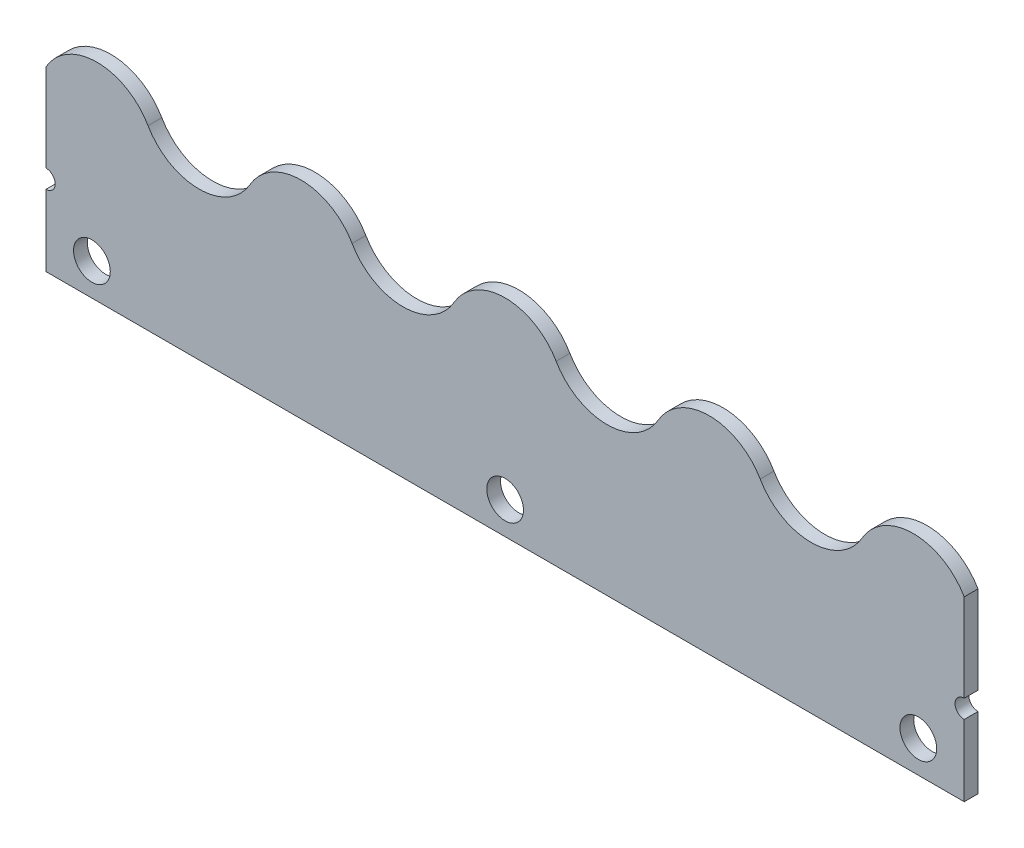
ISO-10303-21;
HEADER;
FILE_DESCRIPTION(('STEP AP214'),'2;1');
FILE_NAME('part.step','',(''),(''),'','','');
FILE_SCHEMA(('AUTOMOTIVE_DESIGN { 1 0 10303 214 1 1 1 1 }'));
ENDSEC;
DATA;
#1=APPLICATION_CONTEXT('core data for automotive mechanical design processes');
#2=APPLICATION_PROTOCOL_DEFINITION('international standard','automotive_design',2000,#1);
#3=PRODUCT_CONTEXT('',#1,'mechanical');
#4=PRODUCT('Part','Part','',(#3));
#5=PRODUCT_RELATED_PRODUCT_CATEGORY('part','',(#4));
#6=PRODUCT_DEFINITION_FORMATION('','',#4);
#7=PRODUCT_DEFINITION_CONTEXT('part definition',#1,'design');
#8=PRODUCT_DEFINITION('design','',#6,#7);
#9=PRODUCT_DEFINITION_SHAPE('','',#8);
#10=(LENGTH_UNIT() NAMED_UNIT(*) SI_UNIT(.MILLI.,.METRE.));
#11=(NAMED_UNIT(*) PLANE_ANGLE_UNIT() SI_UNIT($,.RADIAN.));
#12=(NAMED_UNIT(*) SI_UNIT($,.STERADIAN.) SOLID_ANGLE_UNIT());
#13=UNCERTAINTY_MEASURE_WITH_UNIT(LENGTH_MEASURE(1.E-05),#10,'distance_accuracy_value','');
#14=(GEOMETRIC_REPRESENTATION_CONTEXT(3) GLOBAL_UNCERTAINTY_ASSIGNED_CONTEXT((#13)) GLOBAL_UNIT_ASSIGNED_CONTEXT((#10,
#11,#12)) REPRESENTATION_CONTEXT('',''));
#15=CARTESIAN_POINT('',(0.,0.,0.));
#16=DIRECTION('',(0.,0.,1.));
#17=DIRECTION('',(1.,0.,0.));
#18=AXIS2_PLACEMENT_3D('',#15,#16,#17);
#19=CARTESIAN_POINT('',(0.,0.965708264711482,-3.));
#20=DIRECTION('',(-1.,0.,0.));
#21=DIRECTION('',(0.,1.,0.));
#22=AXIS2_PLACEMENT_3D('',#19,#20,#21);
#23=PLANE('',#22);
#24=DIRECTION('',(0.,0.,1.));
#25=VECTOR('',#24,1.);
#26=CARTESIAN_POINT('',(0.,0.232854132355741,-1.5));
#27=LINE('',#26,#25);
#28=CARTESIAN_POINT('',(0.,0.232854132355741,-1.5));
#29=VERTEX_POINT('',#28);
#30=CARTESIAN_POINT('',(0.,0.232854132355741,0.));
#31=VERTEX_POINT('',#30);
#32=EDGE_CURVE('E232',#29,#31,#27,.T.);
#33=ORIENTED_EDGE('',*,*,#32,.F.);
#34=DIRECTION('',(0.,1.,0.));
#35=VECTOR('',#34,1.);
#36=CARTESIAN_POINT('',(0.,-7.53429173528852,-1.5));
#37=LINE('',#36,#35);
#38=CARTESIAN_POINT('',(0.,-7.53429173528852,-1.5));
#39=VERTEX_POINT('',#38);
#40=EDGE_CURVE('E179',#39,#29,#37,.T.);
#41=ORIENTED_EDGE('',*,*,#40,.F.);
#42=DIRECTION('',(0.,0.,1.));
#43=VECTOR('',#42,1.);
#44=CARTESIAN_POINT('',(0.,-7.53429173528852,-1.5));
#45=LINE('',#44,#43);
#46=CARTESIAN_POINT('',(0.,-7.53429173528852,0.));
#47=VERTEX_POINT('',#46);
#48=EDGE_CURVE('E204',#39,#47,#45,.T.);
#49=ORIENTED_EDGE('',*,*,#48,.T.);
#50=DIRECTION('',(0.,1.,0.));
#51=VECTOR('',#50,1.);
#52=CARTESIAN_POINT('',(0.,-7.53429173528852,0.));
#53=LINE('',#52,#51);
#54=EDGE_CURVE('E200',#47,#31,#53,.T.);
#55=ORIENTED_EDGE('',*,*,#54,.T.);
#56=EDGE_LOOP('',(#33,#41,#49,#55));
#57=FACE_BOUND('',#56,.T.);
#58=ADVANCED_FACE('F45',(#57),#23,.T.);
#59=CARTESIAN_POINT('',(100.,-0.534291735288518,-3.));
#60=DIRECTION('',(1.,0.,0.));
#61=DIRECTION('',(0.,-1.,0.));
#62=AXIS2_PLACEMENT_3D('',#59,#60,#61);
#63=PLANE('',#62);
#64=DIRECTION('',(0.,0.,1.));
#65=VECTOR('',#64,1.);
#66=CARTESIAN_POINT('',(100.,2.23285413235574,-1.5));
#67=LINE('',#66,#65);
#68=CARTESIAN_POINT('',(100.,2.23285413235574,-1.5));
#69=VERTEX_POINT('',#68);
#70=CARTESIAN_POINT('',(100.,2.23285413235574,0.));
#71=VERTEX_POINT('',#70);
#72=EDGE_CURVE('E54',#69,#71,#67,.T.);
#73=ORIENTED_EDGE('',*,*,#72,.F.);
#74=DIRECTION('',(0.,1.,0.));
#75=VECTOR('',#74,1.);
#76=CARTESIAN_POINT('',(100.,-7.53429173528852,-1.5));
#77=LINE('',#76,#75);
#78=CARTESIAN_POINT('',(100.,11.7924985045021,-1.5));
#79=VERTEX_POINT('',#78);
#80=EDGE_CURVE('E194',#69,#79,#77,.T.);
#81=ORIENTED_EDGE('',*,*,#80,.T.);
#82=DIRECTION('',(0.,0.,1.));
#83=VECTOR('',#82,1.);
#84=CARTESIAN_POINT('',(100.,11.7924985045021,-102.019615432912));
#85=LINE('',#84,#83);
#86=CARTESIAN_POINT('',(100.,11.7924985045021,0.));
#87=VERTEX_POINT('',#86);
#88=EDGE_CURVE('E177',#79,#87,#85,.T.);
#89=ORIENTED_EDGE('',*,*,#88,.T.);
#90=DIRECTION('',(0.,1.,0.));
#91=VECTOR('',#90,1.);
#92=CARTESIAN_POINT('',(100.,-7.53429173528852,0.));
#93=LINE('',#92,#91);
#94=EDGE_CURVE('E168',#71,#87,#93,.T.);
#95=ORIENTED_EDGE('',*,*,#94,.F.);
#96=EDGE_LOOP('',(#73,#81,#89,#95));
#97=FACE_BOUND('',#96,.T.);
#98=ADVANCED_FACE('F175',(#97),#63,.T.);
#99=DIRECTION('',(0.,0.,1.));
#100=VECTOR('',#99,1.);
#101=CARTESIAN_POINT('',(0.,2.23285413235574,-1.5));
#102=LINE('',#101,#100);
#103=CARTESIAN_POINT('',(0.,2.23285413235574,0.));
#104=VERTEX_POINT('',#103);
#105=CARTESIAN_POINT('',(0.,2.23285413235574,-1.5));
#106=VERTEX_POINT('',#105);
#107=EDGE_CURVE('E61',#104,#106,#102,.F.);
#108=ORIENTED_EDGE('',*,*,#107,.F.);
#109=CARTESIAN_POINT('',(0.,11.7924985045021,0.));
#110=VERTEX_POINT('',#109);
#111=EDGE_CURVE('E205',#104,#110,#53,.T.);
#112=ORIENTED_EDGE('',*,*,#111,.T.);
#113=DIRECTION('',(0.,0.,1.));
#114=VECTOR('',#113,1.);
#115=CARTESIAN_POINT('',(0.,11.7924985045021,-102.019615432912));
#116=LINE('',#115,#114);
#117=CARTESIAN_POINT('',(0.,11.7924985045021,-1.5));
#118=VERTEX_POINT('',#117);
#119=EDGE_CURVE('E333',#118,#110,#116,.T.);
#120=ORIENTED_EDGE('',*,*,#119,.F.);
#121=EDGE_CURVE('E185',#106,#118,#37,.T.);
#122=ORIENTED_EDGE('',*,*,#121,.F.);
#123=EDGE_LOOP('',(#108,#112,#120,#122));
#124=FACE_BOUND('',#123,.T.);
#125=ADVANCED_FACE('F368',(#124),#23,.T.);
#126=CARTESIAN_POINT('',(100.,0.,0.));
#127=DIRECTION('',(0.,0.,1.));
#128=DIRECTION('',(1.,0.,0.));
#129=AXIS2_PLACEMENT_3D('',#126,#127,#128);
#130=PLANE('',#129);
#131=CARTESIAN_POINT('',(0.,1.23285413235574,0.));
#132=DIRECTION('',(0.,0.,1.));
#133=DIRECTION('',(1.,0.,0.));
#134=AXIS2_PLACEMENT_3D('',#131,#132,#133);
#135=CIRCLE('',#134,1.);
#136=EDGE_CURVE('E222',#31,#104,#135,.T.);
#137=ORIENTED_EDGE('',*,*,#136,.F.);
#138=ORIENTED_EDGE('',*,*,#54,.F.);
#139=DIRECTION('',(-1.,0.,0.));
#140=VECTOR('',#139,1.);
#141=CARTESIAN_POINT('',(100.,-7.53429173528852,0.));
#142=LINE('',#141,#140);
#143=CARTESIAN_POINT('',(100.,-7.53429173528852,0.));
#144=VERTEX_POINT('',#143);
#145=EDGE_CURVE('E211',#144,#47,#142,.T.);
#146=ORIENTED_EDGE('',*,*,#145,.F.);
#147=CARTESIAN_POINT('',(100.,0.232854132355742,0.));
#148=VERTEX_POINT('',#147);
#149=EDGE_CURVE('E171',#144,#148,#93,.T.);
#150=ORIENTED_EDGE('',*,*,#149,.T.);
#151=CARTESIAN_POINT('',(100.,1.23285413235574,0.));
#152=DIRECTION('',(0.,0.,1.));
#153=DIRECTION('',(1.,0.,0.));
#154=AXIS2_PLACEMENT_3D('',#151,#152,#153);
#155=CIRCLE('',#154,0.999999999999998);
#156=EDGE_CURVE('E68',#71,#148,#155,.T.);
#157=ORIENTED_EDGE('',*,*,#156,.F.);
#158=ORIENTED_EDGE('',*,*,#94,.T.);
#159=CARTESIAN_POINT('',(94.4444444444444,8.58499700900415,0.));
#160=DIRECTION('',(0.,0.,-1.));
#161=DIRECTION('',(-1.,0.,0.));
#162=AXIS2_PLACEMENT_3D('',#159,#160,#161);
#163=CIRCLE('',#162,6.41500299099584);
#164=CARTESIAN_POINT('',(88.8888888888889,11.7924985045021,0.));
#165=VERTEX_POINT('',#164);
#166=EDGE_CURVE('E252',#165,#87,#163,.T.);
#167=ORIENTED_EDGE('',*,*,#166,.F.);
#168=CARTESIAN_POINT('',(83.3333333333333,15.,0.));
#169=DIRECTION('',(0.,0.,1.));
#170=DIRECTION('',(1.,0.,0.));
#171=AXIS2_PLACEMENT_3D('',#168,#169,#170);
#172=CIRCLE('',#171,6.41500299099584);
#173=CARTESIAN_POINT('',(77.7777777777778,11.7924985045021,0.));
#174=VERTEX_POINT('',#173);
#175=EDGE_CURVE('E255',#174,#165,#172,.T.);
#176=ORIENTED_EDGE('',*,*,#175,.F.);
#177=CARTESIAN_POINT('',(72.2222222222222,8.58499700900415,0.));
#178=DIRECTION('',(0.,0.,-1.));
#179=DIRECTION('',(-1.,0.,0.));
#180=AXIS2_PLACEMENT_3D('',#177,#178,#179);
#181=CIRCLE('',#180,6.41500299099584);
#182=CARTESIAN_POINT('',(66.6666666666667,11.7924985045021,0.));
#183=VERTEX_POINT('',#182);
#184=EDGE_CURVE('E274',#183,#174,#181,.T.);
#185=ORIENTED_EDGE('',*,*,#184,.F.);
#186=CARTESIAN_POINT('',(61.1111111111111,15.,0.));
#187=DIRECTION('',(0.,0.,1.));
#188=DIRECTION('',(1.,0.,0.));
#189=AXIS2_PLACEMENT_3D('',#186,#187,#188);
#190=CIRCLE('',#189,6.41500299099584);
#191=CARTESIAN_POINT('',(55.5555555555556,11.7924985045021,0.));
#192=VERTEX_POINT('',#191);
#193=EDGE_CURVE('E277',#192,#183,#190,.T.);
#194=ORIENTED_EDGE('',*,*,#193,.F.);
#195=CARTESIAN_POINT('',(50.,8.58499700900416,0.));
#196=DIRECTION('',(0.,0.,-1.));
#197=DIRECTION('',(-1.,0.,0.));
#198=AXIS2_PLACEMENT_3D('',#195,#196,#197);
#199=CIRCLE('',#198,6.41500299099584);
#200=CARTESIAN_POINT('',(44.4444444444444,11.7924985045021,0.));
#201=VERTEX_POINT('',#200);
#202=EDGE_CURVE('E296',#201,#192,#199,.T.);
#203=ORIENTED_EDGE('',*,*,#202,.F.);
#204=CARTESIAN_POINT('',(38.8888888888889,15.,0.));
#205=DIRECTION('',(0.,0.,1.));
#206=DIRECTION('',(1.,0.,0.));
#207=AXIS2_PLACEMENT_3D('',#204,#205,#206);
#208=CIRCLE('',#207,6.41500299099584);
#209=CARTESIAN_POINT('',(33.3333333333333,11.7924985045021,0.));
#210=VERTEX_POINT('',#209);
#211=EDGE_CURVE('E299',#210,#201,#208,.T.);
#212=ORIENTED_EDGE('',*,*,#211,.F.);
#213=CARTESIAN_POINT('',(27.7777777777778,8.58499700900416,0.));
#214=DIRECTION('',(0.,0.,-1.));
#215=DIRECTION('',(-1.,0.,0.));
#216=AXIS2_PLACEMENT_3D('',#213,#214,#215);
#217=CIRCLE('',#216,6.41500299099584);
#218=CARTESIAN_POINT('',(22.2222222222222,11.7924985045021,0.));
#219=VERTEX_POINT('',#218);
#220=EDGE_CURVE('E318',#219,#210,#217,.T.);
#221=ORIENTED_EDGE('',*,*,#220,.F.);
#222=CARTESIAN_POINT('',(16.6666666666667,15.,0.));
#223=DIRECTION('',(0.,0.,1.));
#224=DIRECTION('',(1.,0.,0.));
#225=AXIS2_PLACEMENT_3D('',#222,#223,#224);
#226=CIRCLE('',#225,6.41500299099584);
#227=CARTESIAN_POINT('',(11.1111111111111,11.7924985045021,0.));
#228=VERTEX_POINT('',#227);
#229=EDGE_CURVE('E321',#228,#219,#226,.T.);
#230=ORIENTED_EDGE('',*,*,#229,.F.);
#231=CARTESIAN_POINT('',(5.55555555555556,8.58499700900416,0.));
#232=DIRECTION('',(0.,0.,-1.));
#233=DIRECTION('',(-1.,0.,0.));
#234=AXIS2_PLACEMENT_3D('',#231,#232,#233);
#235=CIRCLE('',#234,6.41500299099584);
#236=EDGE_CURVE('E234',#110,#228,#235,.T.);
#237=ORIENTED_EDGE('',*,*,#236,.F.);
#238=ORIENTED_EDGE('',*,*,#111,.F.);
#239=EDGE_LOOP('',(#137,#138,#146,#150,#157,#158,#167,#176,#185,#194,#203,#212,#221,#230,#237,#238));
#240=FACE_BOUND('',#239,.T.);
#241=CARTESIAN_POINT('',(5.,-4.03429173528852,0.));
#242=DIRECTION('',(0.,0.,1.));
#243=DIRECTION('',(0.,-1.,0.));
#244=AXIS2_PLACEMENT_3D('',#241,#242,#243);
#245=CIRCLE('',#244,2.);
#246=CARTESIAN_POINT('',(5.,-6.03429173528852,0.));
#247=VERTEX_POINT('',#246);
#248=EDGE_CURVE('E345',#247,#247,#245,.F.);
#249=ORIENTED_EDGE('',*,*,#248,.T.);
#250=EDGE_LOOP('',(#249));
#251=FACE_BOUND('',#250,.T.);
#252=CARTESIAN_POINT('',(95.,-4.03429173528852,0.));
#253=DIRECTION('',(0.,0.,1.));
#254=DIRECTION('',(0.,-1.,0.));
#255=AXIS2_PLACEMENT_3D('',#252,#253,#254);
#256=CIRCLE('',#255,2.);
#257=CARTESIAN_POINT('',(95.,-6.03429173528852,0.));
#258=VERTEX_POINT('',#257);
#259=EDGE_CURVE('E344',#258,#258,#256,.F.);
#260=ORIENTED_EDGE('',*,*,#259,.T.);
#261=EDGE_LOOP('',(#260));
#262=FACE_BOUND('',#261,.T.);
#263=CARTESIAN_POINT('',(50.,-4.03429173528852,0.));
#264=DIRECTION('',(0.,0.,1.));
#265=DIRECTION('',(0.,-1.,0.));
#266=AXIS2_PLACEMENT_3D('',#263,#264,#265);
#267=CIRCLE('',#266,2.);
#268=CARTESIAN_POINT('',(50.,-6.03429173528852,0.));
#269=VERTEX_POINT('',#268);
#270=EDGE_CURVE('E189',#269,#269,#267,.F.);
#271=ORIENTED_EDGE('',*,*,#270,.T.);
#272=EDGE_LOOP('',(#271));
#273=FACE_BOUND('',#272,.T.);
#274=ADVANCED_FACE('F47',(#240,#251,#262,#273),#130,.T.);
#275=CARTESIAN_POINT('',(100.,-7.53429173528852,-1.5));
#276=DIRECTION('',(0.,-1.,0.));
#277=DIRECTION('',(-1.,0.,0.));
#278=AXIS2_PLACEMENT_3D('',#275,#276,#277);
#279=PLANE('',#278);
#280=ORIENTED_EDGE('',*,*,#48,.F.);
#281=DIRECTION('',(-1.,0.,0.));
#282=VECTOR('',#281,1.);
#283=CARTESIAN_POINT('',(100.,-7.53429173528852,-1.5));
#284=LINE('',#283,#282);
#285=CARTESIAN_POINT('',(100.,-7.53429173528852,-1.5));
#286=VERTEX_POINT('',#285);
#287=EDGE_CURVE('E199',#286,#39,#284,.T.);
#288=ORIENTED_EDGE('',*,*,#287,.F.);
#289=DIRECTION('',(0.,0.,1.));
#290=VECTOR('',#289,1.);
#291=CARTESIAN_POINT('',(100.,-7.53429173528852,-1.5));
#292=LINE('',#291,#290);
#293=EDGE_CURVE('E183',#286,#144,#292,.T.);
#294=ORIENTED_EDGE('',*,*,#293,.T.);
#295=ORIENTED_EDGE('',*,*,#145,.T.);
#296=EDGE_LOOP('',(#280,#288,#294,#295));
#297=FACE_BOUND('',#296,.T.);
#298=ADVANCED_FACE('F227',(#297),#279,.T.);
#299=CARTESIAN_POINT('',(100.,-7.53429173528852,-1.5));
#300=DIRECTION('',(0.,0.,1.));
#301=DIRECTION('',(0.,-1.,0.));
#302=AXIS2_PLACEMENT_3D('',#299,#300,#301);
#303=PLANE('',#302);
#304=CARTESIAN_POINT('',(5.,-4.03429173528852,-1.5));
#305=DIRECTION('',(0.,0.,-1.));
#306=DIRECTION('',(0.,1.,0.));
#307=AXIS2_PLACEMENT_3D('',#304,#305,#306);
#308=CIRCLE('',#307,2.);
#309=CARTESIAN_POINT('',(5.,-2.03429173528852,-1.5));
#310=VERTEX_POINT('',#309);
#311=EDGE_CURVE('E244',#310,#310,#308,.T.);
#312=ORIENTED_EDGE('',*,*,#311,.F.);
#313=EDGE_LOOP('',(#312));
#314=FACE_BOUND('',#313,.T.);
#315=CARTESIAN_POINT('',(95.,-4.03429173528852,-1.5));
#316=DIRECTION('',(0.,0.,-1.));
#317=DIRECTION('',(0.,1.,0.));
#318=AXIS2_PLACEMENT_3D('',#315,#316,#317);
#319=CIRCLE('',#318,2.);
#320=CARTESIAN_POINT('',(95.,-2.03429173528852,-1.5));
#321=VERTEX_POINT('',#320);
#322=EDGE_CURVE('E340',#321,#321,#319,.T.);
#323=ORIENTED_EDGE('',*,*,#322,.F.);
#324=EDGE_LOOP('',(#323));
#325=FACE_BOUND('',#324,.T.);
#326=CARTESIAN_POINT('',(50.,-4.03429173528852,-1.5));
#327=DIRECTION('',(0.,0.,-1.));
#328=DIRECTION('',(0.,1.,0.));
#329=AXIS2_PLACEMENT_3D('',#326,#327,#328);
#330=CIRCLE('',#329,2.);
#331=CARTESIAN_POINT('',(50.,-2.03429173528852,-1.5));
#332=VERTEX_POINT('',#331);
#333=EDGE_CURVE('E349',#332,#332,#330,.T.);
#334=ORIENTED_EDGE('',*,*,#333,.F.);
#335=EDGE_LOOP('',(#334));
#336=FACE_BOUND('',#335,.T.);
#337=ORIENTED_EDGE('',*,*,#40,.T.);
#338=CARTESIAN_POINT('',(0.,1.23285413235574,-1.5));
#339=DIRECTION('',(0.,0.,1.));
#340=DIRECTION('',(0.,-1.,0.));
#341=AXIS2_PLACEMENT_3D('',#338,#339,#340);
#342=CIRCLE('',#341,1.);
#343=EDGE_CURVE('E12',#29,#106,#342,.T.);
#344=ORIENTED_EDGE('',*,*,#343,.T.);
#345=ORIENTED_EDGE('',*,*,#121,.T.);
#346=CARTESIAN_POINT('',(5.55555555555556,8.58499700900416,-1.5));
#347=DIRECTION('',(0.,0.,1.));
#348=DIRECTION('',(1.,0.,0.));
#349=AXIS2_PLACEMENT_3D('',#346,#347,#348);
#350=CIRCLE('',#349,6.41500299099584);
#351=CARTESIAN_POINT('',(11.1111111111111,11.7924985045021,-1.5));
#352=VERTEX_POINT('',#351);
#353=EDGE_CURVE('E238',#352,#118,#350,.T.);
#354=ORIENTED_EDGE('',*,*,#353,.F.);
#355=CARTESIAN_POINT('',(16.6666666666667,15.,-1.5));
#356=DIRECTION('',(0.,0.,1.));
#357=DIRECTION('',(1.,0.,0.));
#358=AXIS2_PLACEMENT_3D('',#355,#356,#357);
#359=CIRCLE('',#358,6.41500299099584);
#360=CARTESIAN_POINT('',(22.2222222222222,11.7924985045021,-1.5));
#361=VERTEX_POINT('',#360);
#362=EDGE_CURVE('E329',#361,#352,#359,.F.);
#363=ORIENTED_EDGE('',*,*,#362,.F.);
#364=CARTESIAN_POINT('',(27.7777777777778,8.58499700900416,-1.5));
#365=DIRECTION('',(0.,0.,1.));
#366=DIRECTION('',(1.,0.,0.));
#367=AXIS2_PLACEMENT_3D('',#364,#365,#366);
#368=CIRCLE('',#367,6.41500299099584);
#369=CARTESIAN_POINT('',(33.3333333333333,11.7924985045021,-1.5));
#370=VERTEX_POINT('',#369);
#371=EDGE_CURVE('E315',#370,#361,#368,.T.);
#372=ORIENTED_EDGE('',*,*,#371,.F.);
#373=CARTESIAN_POINT('',(38.8888888888889,15.,-1.5));
#374=DIRECTION('',(0.,0.,1.));
#375=DIRECTION('',(1.,0.,0.));
#376=AXIS2_PLACEMENT_3D('',#373,#374,#375);
#377=CIRCLE('',#376,6.41500299099584);
#378=CARTESIAN_POINT('',(44.4444444444444,11.7924985045021,-1.5));
#379=VERTEX_POINT('',#378);
#380=EDGE_CURVE('E307',#379,#370,#377,.F.);
#381=ORIENTED_EDGE('',*,*,#380,.F.);
#382=CARTESIAN_POINT('',(50.,8.58499700900416,-1.5));
#383=DIRECTION('',(0.,0.,1.));
#384=DIRECTION('',(1.,0.,0.));
#385=AXIS2_PLACEMENT_3D('',#382,#383,#384);
#386=CIRCLE('',#385,6.41500299099584);
#387=CARTESIAN_POINT('',(55.5555555555556,11.7924985045021,-1.5));
#388=VERTEX_POINT('',#387);
#389=EDGE_CURVE('E293',#388,#379,#386,.T.);
#390=ORIENTED_EDGE('',*,*,#389,.F.);
#391=CARTESIAN_POINT('',(61.1111111111111,15.,-1.5));
#392=DIRECTION('',(0.,0.,1.));
#393=DIRECTION('',(1.,0.,0.));
#394=AXIS2_PLACEMENT_3D('',#391,#392,#393);
#395=CIRCLE('',#394,6.41500299099584);
#396=CARTESIAN_POINT('',(66.6666666666667,11.7924985045021,-1.5));
#397=VERTEX_POINT('',#396);
#398=EDGE_CURVE('E285',#397,#388,#395,.F.);
#399=ORIENTED_EDGE('',*,*,#398,.F.);
#400=CARTESIAN_POINT('',(72.2222222222222,8.58499700900415,-1.5));
#401=DIRECTION('',(0.,0.,1.));
#402=DIRECTION('',(1.,0.,0.));
#403=AXIS2_PLACEMENT_3D('',#400,#401,#402);
#404=CIRCLE('',#403,6.41500299099584);
#405=CARTESIAN_POINT('',(77.7777777777778,11.7924985045021,-1.5));
#406=VERTEX_POINT('',#405);
#407=EDGE_CURVE('E271',#406,#397,#404,.T.);
#408=ORIENTED_EDGE('',*,*,#407,.F.);
#409=CARTESIAN_POINT('',(83.3333333333333,15.,-1.5));
#410=DIRECTION('',(0.,0.,1.));
#411=DIRECTION('',(1.,0.,0.));
#412=AXIS2_PLACEMENT_3D('',#409,#410,#411);
#413=CIRCLE('',#412,6.41500299099584);
#414=CARTESIAN_POINT('',(88.8888888888889,11.7924985045021,-1.5));
#415=VERTEX_POINT('',#414);
#416=EDGE_CURVE('E263',#415,#406,#413,.F.);
#417=ORIENTED_EDGE('',*,*,#416,.F.);
#418=CARTESIAN_POINT('',(94.4444444444444,8.58499700900415,-1.5));
#419=DIRECTION('',(0.,0.,1.));
#420=DIRECTION('',(1.,0.,0.));
#421=AXIS2_PLACEMENT_3D('',#418,#419,#420);
#422=CIRCLE('',#421,6.41500299099584);
#423=EDGE_CURVE('E249',#79,#415,#422,.T.);
#424=ORIENTED_EDGE('',*,*,#423,.F.);
#425=ORIENTED_EDGE('',*,*,#80,.F.);
#426=CARTESIAN_POINT('',(100.,1.23285413235574,-1.5));
#427=DIRECTION('',(0.,0.,1.));
#428=DIRECTION('',(1.,0.,0.));
#429=AXIS2_PLACEMENT_3D('',#426,#427,#428);
#430=CIRCLE('',#429,0.999999999999998);
#431=CARTESIAN_POINT('',(100.,0.232854132355742,-1.5));
#432=VERTEX_POINT('',#431);
#433=EDGE_CURVE('E158',#69,#432,#430,.T.);
#434=ORIENTED_EDGE('',*,*,#433,.T.);
#435=EDGE_CURVE('E195',#286,#432,#77,.T.);
#436=ORIENTED_EDGE('',*,*,#435,.F.);
#437=ORIENTED_EDGE('',*,*,#287,.T.);
#438=EDGE_LOOP('',(#337,#344,#345,#354,#363,#372,#381,#390,#399,#408,#417,#424,#425,#434,#436,#437));
#439=FACE_BOUND('',#438,.T.);
#440=ADVANCED_FACE('F218',(#314,#325,#336,#439),#303,.F.);
#441=DIRECTION('',(0.,0.,1.));
#442=VECTOR('',#441,1.);
#443=CARTESIAN_POINT('',(100.,0.232854132355742,-1.5));
#444=LINE('',#443,#442);
#445=EDGE_CURVE('E163',#148,#432,#444,.F.);
#446=ORIENTED_EDGE('',*,*,#445,.F.);
#447=ORIENTED_EDGE('',*,*,#149,.F.);
#448=ORIENTED_EDGE('',*,*,#293,.F.);
#449=ORIENTED_EDGE('',*,*,#435,.T.);
#450=EDGE_LOOP('',(#446,#447,#448,#449));
#451=FACE_BOUND('',#450,.T.);
#452=ADVANCED_FACE('F224',(#451),#63,.T.);
#453=CARTESIAN_POINT('',(50.,-4.03429173528852,5.65685424949239));
#454=DIRECTION('',(0.,0.,-1.));
#455=DIRECTION('',(0.,1.,0.));
#456=AXIS2_PLACEMENT_3D('',#453,#454,#455);
#457=CYLINDRICAL_SURFACE('',#456,2.);
#458=ORIENTED_EDGE('',*,*,#333,.T.);
#459=EDGE_LOOP('',(#458));
#460=FACE_BOUND('',#459,.T.);
#461=ORIENTED_EDGE('',*,*,#270,.F.);
#462=EDGE_LOOP('',(#461));
#463=FACE_BOUND('',#462,.T.);
#464=ADVANCED_FACE('F434',(#460,#463),#457,.F.);
#465=CARTESIAN_POINT('',(95.,-4.03429173528852,5.65685424949239));
#466=DIRECTION('',(0.,0.,-1.));
#467=DIRECTION('',(0.,1.,0.));
#468=AXIS2_PLACEMENT_3D('',#465,#466,#467);
#469=CYLINDRICAL_SURFACE('',#468,2.);
#470=ORIENTED_EDGE('',*,*,#322,.T.);
#471=EDGE_LOOP('',(#470));
#472=FACE_BOUND('',#471,.T.);
#473=ORIENTED_EDGE('',*,*,#259,.F.);
#474=EDGE_LOOP('',(#473));
#475=FACE_BOUND('',#474,.T.);
#476=ADVANCED_FACE('F437',(#472,#475),#469,.F.);
#477=CARTESIAN_POINT('',(5.,-4.03429173528852,5.65685424949239));
#478=DIRECTION('',(0.,0.,-1.));
#479=DIRECTION('',(0.,1.,0.));
#480=AXIS2_PLACEMENT_3D('',#477,#478,#479);
#481=CYLINDRICAL_SURFACE('',#480,2.);
#482=ORIENTED_EDGE('',*,*,#311,.T.);
#483=EDGE_LOOP('',(#482));
#484=FACE_BOUND('',#483,.T.);
#485=ORIENTED_EDGE('',*,*,#248,.F.);
#486=EDGE_LOOP('',(#485));
#487=FACE_BOUND('',#486,.T.);
#488=ADVANCED_FACE('F438',(#484,#487),#481,.F.);
#489=CARTESIAN_POINT('',(5.55555555555556,8.58499700900416,-102.019615432912));
#490=DIRECTION('',(0.,0.,1.));
#491=DIRECTION('',(1.,0.,0.));
#492=AXIS2_PLACEMENT_3D('',#489,#490,#491);
#493=CYLINDRICAL_SURFACE('',#492,6.41500299099584);
#494=ORIENTED_EDGE('',*,*,#236,.T.);
#495=DIRECTION('',(0.,0.,1.));
#496=VECTOR('',#495,1.);
#497=CARTESIAN_POINT('',(11.1111111111111,11.7924985045021,-102.019615432912));
#498=LINE('',#497,#496);
#499=EDGE_CURVE('E325',#352,#228,#498,.T.);
#500=ORIENTED_EDGE('',*,*,#499,.F.);
#501=ORIENTED_EDGE('',*,*,#353,.T.);
#502=ORIENTED_EDGE('',*,*,#119,.T.);
#503=EDGE_LOOP('',(#494,#500,#501,#502));
#504=FACE_BOUND('',#503,.T.);
#505=ADVANCED_FACE('F373',(#504),#493,.T.);
#506=CARTESIAN_POINT('',(16.6666666666667,15.,-102.019615432912));
#507=DIRECTION('',(0.,0.,1.));
#508=DIRECTION('',(1.,0.,0.));
#509=AXIS2_PLACEMENT_3D('',#506,#507,#508);
#510=CYLINDRICAL_SURFACE('',#509,6.41500299099584);
#511=ORIENTED_EDGE('',*,*,#362,.T.);
#512=ORIENTED_EDGE('',*,*,#499,.T.);
#513=ORIENTED_EDGE('',*,*,#229,.T.);
#514=DIRECTION('',(0.,0.,1.));
#515=VECTOR('',#514,1.);
#516=CARTESIAN_POINT('',(22.2222222222222,11.7924985045021,-102.019615432912));
#517=LINE('',#516,#515);
#518=EDGE_CURVE('E311',#361,#219,#517,.T.);
#519=ORIENTED_EDGE('',*,*,#518,.F.);
#520=EDGE_LOOP('',(#511,#512,#513,#519));
#521=FACE_BOUND('',#520,.T.);
#522=ADVANCED_FACE('F377',(#521),#510,.F.);
#523=CARTESIAN_POINT('',(27.7777777777778,8.58499700900416,-102.019615432912));
#524=DIRECTION('',(0.,0.,1.));
#525=DIRECTION('',(1.,0.,0.));
#526=AXIS2_PLACEMENT_3D('',#523,#524,#525);
#527=CYLINDRICAL_SURFACE('',#526,6.41500299099584);
#528=ORIENTED_EDGE('',*,*,#220,.T.);
#529=DIRECTION('',(0.,0.,1.));
#530=VECTOR('',#529,1.);
#531=CARTESIAN_POINT('',(33.3333333333333,11.7924985045021,-102.019615432912));
#532=LINE('',#531,#530);
#533=EDGE_CURVE('E303',#370,#210,#532,.T.);
#534=ORIENTED_EDGE('',*,*,#533,.F.);
#535=ORIENTED_EDGE('',*,*,#371,.T.);
#536=ORIENTED_EDGE('',*,*,#518,.T.);
#537=EDGE_LOOP('',(#528,#534,#535,#536));
#538=FACE_BOUND('',#537,.T.);
#539=ADVANCED_FACE('F379',(#538),#527,.T.);
#540=CARTESIAN_POINT('',(38.8888888888889,15.,-102.019615432912));
#541=DIRECTION('',(0.,0.,1.));
#542=DIRECTION('',(1.,0.,0.));
#543=AXIS2_PLACEMENT_3D('',#540,#541,#542);
#544=CYLINDRICAL_SURFACE('',#543,6.41500299099584);
#545=ORIENTED_EDGE('',*,*,#380,.T.);
#546=ORIENTED_EDGE('',*,*,#533,.T.);
#547=ORIENTED_EDGE('',*,*,#211,.T.);
#548=DIRECTION('',(0.,0.,1.));
#549=VECTOR('',#548,1.);
#550=CARTESIAN_POINT('',(44.4444444444444,11.7924985045021,-102.019615432912));
#551=LINE('',#550,#549);
#552=EDGE_CURVE('E289',#379,#201,#551,.T.);
#553=ORIENTED_EDGE('',*,*,#552,.F.);
#554=EDGE_LOOP('',(#545,#546,#547,#553));
#555=FACE_BOUND('',#554,.T.);
#556=ADVANCED_FACE('F384',(#555),#544,.F.);
#557=CARTESIAN_POINT('',(50.,8.58499700900416,-102.019615432912));
#558=DIRECTION('',(0.,0.,1.));
#559=DIRECTION('',(1.,0.,0.));
#560=AXIS2_PLACEMENT_3D('',#557,#558,#559);
#561=CYLINDRICAL_SURFACE('',#560,6.41500299099584);
#562=ORIENTED_EDGE('',*,*,#202,.T.);
#563=DIRECTION('',(0.,0.,1.));
#564=VECTOR('',#563,1.);
#565=CARTESIAN_POINT('',(55.5555555555556,11.7924985045021,-102.019615432912));
#566=LINE('',#565,#564);
#567=EDGE_CURVE('E281',#388,#192,#566,.T.);
#568=ORIENTED_EDGE('',*,*,#567,.F.);
#569=ORIENTED_EDGE('',*,*,#389,.T.);
#570=ORIENTED_EDGE('',*,*,#552,.T.);
#571=EDGE_LOOP('',(#562,#568,#569,#570));
#572=FACE_BOUND('',#571,.T.);
#573=ADVANCED_FACE('F387',(#572),#561,.T.);
#574=CARTESIAN_POINT('',(61.1111111111111,15.,-102.019615432912));
#575=DIRECTION('',(0.,0.,1.));
#576=DIRECTION('',(1.,0.,0.));
#577=AXIS2_PLACEMENT_3D('',#574,#575,#576);
#578=CYLINDRICAL_SURFACE('',#577,6.41500299099584);
#579=ORIENTED_EDGE('',*,*,#398,.T.);
#580=ORIENTED_EDGE('',*,*,#567,.T.);
#581=ORIENTED_EDGE('',*,*,#193,.T.);
#582=DIRECTION('',(0.,0.,1.));
#583=VECTOR('',#582,1.);
#584=CARTESIAN_POINT('',(66.6666666666667,11.7924985045021,-102.019615432912));
#585=LINE('',#584,#583);
#586=EDGE_CURVE('E267',#397,#183,#585,.T.);
#587=ORIENTED_EDGE('',*,*,#586,.F.);
#588=EDGE_LOOP('',(#579,#580,#581,#587));
#589=FACE_BOUND('',#588,.T.);
#590=ADVANCED_FACE('F392',(#589),#578,.F.);
#591=CARTESIAN_POINT('',(72.2222222222222,8.58499700900415,-102.019615432912));
#592=DIRECTION('',(0.,0.,1.));
#593=DIRECTION('',(1.,0.,0.));
#594=AXIS2_PLACEMENT_3D('',#591,#592,#593);
#595=CYLINDRICAL_SURFACE('',#594,6.41500299099584);
#596=ORIENTED_EDGE('',*,*,#184,.T.);
#597=DIRECTION('',(0.,0.,1.));
#598=VECTOR('',#597,1.);
#599=CARTESIAN_POINT('',(77.7777777777778,11.7924985045021,-102.019615432912));
#600=LINE('',#599,#598);
#601=EDGE_CURVE('E259',#406,#174,#600,.T.);
#602=ORIENTED_EDGE('',*,*,#601,.F.);
#603=ORIENTED_EDGE('',*,*,#407,.T.);
#604=ORIENTED_EDGE('',*,*,#586,.T.);
#605=EDGE_LOOP('',(#596,#602,#603,#604));
#606=FACE_BOUND('',#605,.T.);
#607=ADVANCED_FACE('F395',(#606),#595,.T.);
#608=CARTESIAN_POINT('',(83.3333333333333,15.,-102.019615432912));
#609=DIRECTION('',(0.,0.,1.));
#610=DIRECTION('',(1.,0.,0.));
#611=AXIS2_PLACEMENT_3D('',#608,#609,#610);
#612=CYLINDRICAL_SURFACE('',#611,6.41500299099584);
#613=ORIENTED_EDGE('',*,*,#416,.T.);
#614=ORIENTED_EDGE('',*,*,#601,.T.);
#615=ORIENTED_EDGE('',*,*,#175,.T.);
#616=DIRECTION('',(0.,0.,1.));
#617=VECTOR('',#616,1.);
#618=CARTESIAN_POINT('',(88.8888888888889,11.7924985045021,-102.019615432912));
#619=LINE('',#618,#617);
#620=EDGE_CURVE('E245',#415,#165,#619,.T.);
#621=ORIENTED_EDGE('',*,*,#620,.F.);
#622=EDGE_LOOP('',(#613,#614,#615,#621));
#623=FACE_BOUND('',#622,.T.);
#624=ADVANCED_FACE('F400',(#623),#612,.F.);
#625=CARTESIAN_POINT('',(94.4444444444444,8.58499700900415,-102.019615432912));
#626=DIRECTION('',(0.,0.,1.));
#627=DIRECTION('',(1.,0.,0.));
#628=AXIS2_PLACEMENT_3D('',#625,#626,#627);
#629=CYLINDRICAL_SURFACE('',#628,6.41500299099584);
#630=ORIENTED_EDGE('',*,*,#166,.T.);
#631=ORIENTED_EDGE('',*,*,#88,.F.);
#632=ORIENTED_EDGE('',*,*,#423,.T.);
#633=ORIENTED_EDGE('',*,*,#620,.T.);
#634=EDGE_LOOP('',(#630,#631,#632,#633));
#635=FACE_BOUND('',#634,.T.);
#636=ADVANCED_FACE('F403',(#635),#629,.T.);
#637=CARTESIAN_POINT('',(100.,1.23285413235574,-1.5));
#638=DIRECTION('',(0.,0.,1.));
#639=DIRECTION('',(1.,0.,0.));
#640=AXIS2_PLACEMENT_3D('',#637,#638,#639);
#641=CYLINDRICAL_SURFACE('',#640,0.999999999999998);
#642=ORIENTED_EDGE('',*,*,#72,.T.);
#643=ORIENTED_EDGE('',*,*,#156,.T.);
#644=ORIENTED_EDGE('',*,*,#445,.T.);
#645=ORIENTED_EDGE('',*,*,#433,.F.);
#646=EDGE_LOOP('',(#642,#643,#644,#645));
#647=FACE_BOUND('',#646,.T.);
#648=ADVANCED_FACE('F156',(#647),#641,.F.);
#649=CARTESIAN_POINT('',(0.,1.23285413235574,-1.5));
#650=DIRECTION('',(0.,0.,1.));
#651=DIRECTION('',(1.,0.,0.));
#652=AXIS2_PLACEMENT_3D('',#649,#650,#651);
#653=CYLINDRICAL_SURFACE('',#652,1.);
#654=ORIENTED_EDGE('',*,*,#32,.T.);
#655=ORIENTED_EDGE('',*,*,#136,.T.);
#656=ORIENTED_EDGE('',*,*,#107,.T.);
#657=ORIENTED_EDGE('',*,*,#343,.F.);
#658=EDGE_LOOP('',(#654,#655,#656,#657));
#659=FACE_BOUND('',#658,.T.);
#660=ADVANCED_FACE('F410',(#659),#653,.F.);
#661=CLOSED_SHELL('',(#58,#98,#125,#274,#298,#440,#452,#464,#476,#488,#505,#522,#539,#556,#573,
#590,#607,#624,#636,#648,#660));
#662=MANIFOLD_SOLID_BREP('B2',#661);
#663=ADVANCED_BREP_SHAPE_REPRESENTATION('',(#18,#662),#14);
#664=SHAPE_DEFINITION_REPRESENTATION(#9,#663);
ENDSEC;
END-ISO-10303-21;
